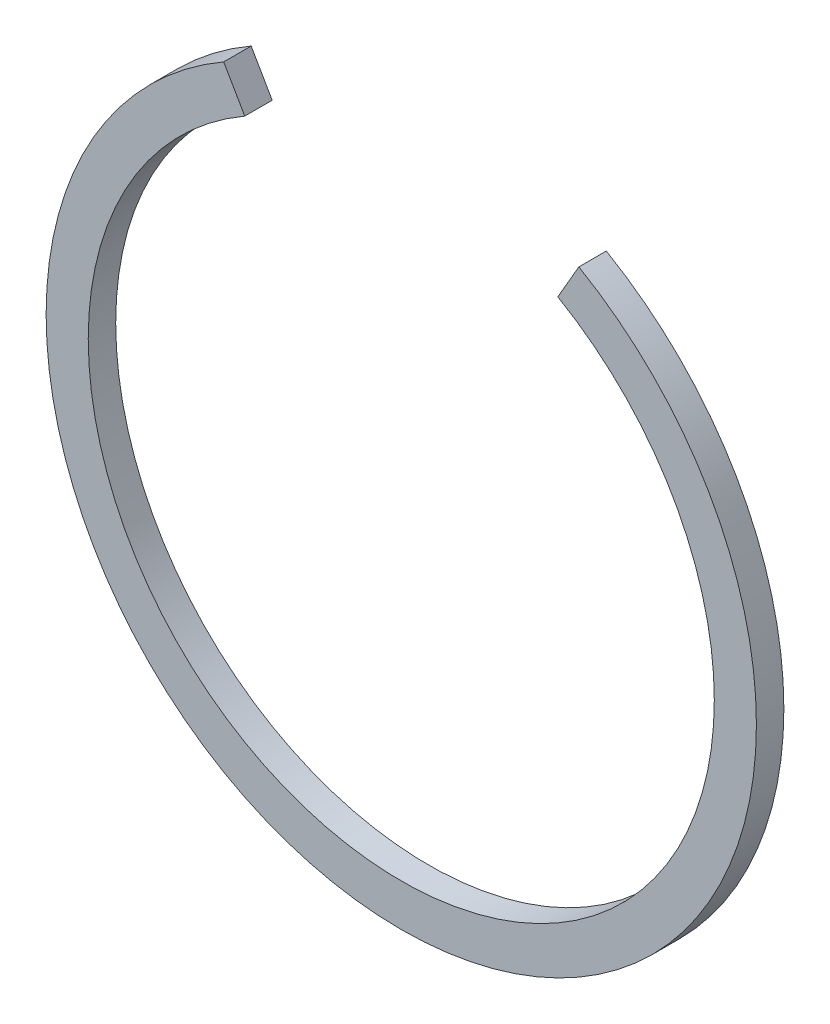
ISO-10303-21;
HEADER;
FILE_DESCRIPTION(('STEP AP214'),'2;1');
FILE_NAME('part.step','',(''),(''),'','','');
FILE_SCHEMA(('AUTOMOTIVE_DESIGN { 1 0 10303 214 1 1 1 1 }'));
ENDSEC;
DATA;
#1=APPLICATION_CONTEXT('core data for automotive mechanical design processes');
#2=APPLICATION_PROTOCOL_DEFINITION('international standard','automotive_design',2000,#1);
#3=PRODUCT_CONTEXT('',#1,'mechanical');
#4=PRODUCT('Part','Part','',(#3));
#5=PRODUCT_RELATED_PRODUCT_CATEGORY('part','',(#4));
#6=PRODUCT_DEFINITION_FORMATION('','',#4);
#7=PRODUCT_DEFINITION_CONTEXT('part definition',#1,'design');
#8=PRODUCT_DEFINITION('design','',#6,#7);
#9=PRODUCT_DEFINITION_SHAPE('','',#8);
#10=(LENGTH_UNIT() NAMED_UNIT(*) SI_UNIT(.MILLI.,.METRE.));
#11=(NAMED_UNIT(*) PLANE_ANGLE_UNIT() SI_UNIT($,.RADIAN.));
#12=(NAMED_UNIT(*) SI_UNIT($,.STERADIAN.) SOLID_ANGLE_UNIT());
#13=UNCERTAINTY_MEASURE_WITH_UNIT(LENGTH_MEASURE(1.E-05),#10,'distance_accuracy_value','');
#14=(GEOMETRIC_REPRESENTATION_CONTEXT(3) GLOBAL_UNCERTAINTY_ASSIGNED_CONTEXT((#13)) GLOBAL_UNIT_ASSIGNED_CONTEXT((#10,
#11,#12)) REPRESENTATION_CONTEXT('',''));
#15=CARTESIAN_POINT('',(0.,0.,0.));
#16=DIRECTION('',(0.,0.,1.));
#17=DIRECTION('',(1.,0.,0.));
#18=AXIS2_PLACEMENT_3D('',#15,#16,#17);
#19=CARTESIAN_POINT('',(0.,0.,1.5));
#20=DIRECTION('',(0.,0.,1.));
#21=DIRECTION('',(1.,0.,0.));
#22=AXIS2_PLACEMENT_3D('',#19,#20,#21);
#23=PLANE('',#22);
#24=CARTESIAN_POINT('',(0.,0.,1.5));
#25=DIRECTION('',(0.,0.,-1.));
#26=DIRECTION('',(-1.,0.,0.));
#27=AXIS2_PLACEMENT_3D('',#24,#25,#26);
#28=CIRCLE('',#27,19.4);
#29=CARTESIAN_POINT('',(-19.4,0.,1.5));
#30=VERTEX_POINT('',#29);
#31=CARTESIAN_POINT('',(-9.7,16.80089283342,1.5));
#32=VERTEX_POINT('',#31);
#33=EDGE_CURVE('E11',#30,#32,#28,.T.);
#34=ORIENTED_EDGE('',*,*,#33,.F.);
#35=CARTESIAN_POINT('',(0.,0.,1.5));
#36=DIRECTION('',(0.,0.,-1.));
#37=DIRECTION('',(1.,0.,0.));
#38=AXIS2_PLACEMENT_3D('',#35,#36,#37);
#39=CIRCLE('',#38,19.4);
#40=CARTESIAN_POINT('',(19.4,0.,1.5));
#41=VERTEX_POINT('',#40);
#42=EDGE_CURVE('E26',#41,#30,#39,.T.);
#43=ORIENTED_EDGE('',*,*,#42,.F.);
#44=CARTESIAN_POINT('',(0.,0.,1.5));
#45=DIRECTION('',(0.,0.,-1.));
#46=DIRECTION('',(0.499999999999974,0.866025403784454,0.));
#47=AXIS2_PLACEMENT_3D('',#44,#45,#46);
#48=CIRCLE('',#47,19.4);
#49=CARTESIAN_POINT('',(9.699999999999,16.80089283342,1.5));
#50=VERTEX_POINT('',#49);
#51=EDGE_CURVE('E145',#50,#41,#48,.T.);
#52=ORIENTED_EDGE('',*,*,#51,.F.);
#53=DIRECTION('',(0.499999999999319,0.866025403784832,0.));
#54=VECTOR('',#53,1.);
#55=CARTESIAN_POINT('',(8.549999999999,14.80903440471,1.5));
#56=LINE('',#55,#54);
#57=CARTESIAN_POINT('',(8.549999999999,14.80903440471,1.5));
#58=VERTEX_POINT('',#57);
#59=EDGE_CURVE('E154',#58,#50,#56,.T.);
#60=ORIENTED_EDGE('',*,*,#59,.F.);
#61=CARTESIAN_POINT('',(0.,0.,1.5));
#62=DIRECTION('',(0.,0.,1.));
#63=DIRECTION('',(1.,0.,0.));
#64=AXIS2_PLACEMENT_3D('',#61,#62,#63);
#65=CIRCLE('',#64,17.1);
#66=CARTESIAN_POINT('',(17.1,0.,1.5));
#67=VERTEX_POINT('',#66);
#68=EDGE_CURVE('E134',#67,#58,#65,.T.);
#69=ORIENTED_EDGE('',*,*,#68,.F.);
#70=CARTESIAN_POINT('',(0.,0.,1.5));
#71=DIRECTION('',(0.,0.,1.));
#72=DIRECTION('',(-1.,0.,0.));
#73=AXIS2_PLACEMENT_3D('',#70,#71,#72);
#74=CIRCLE('',#73,17.1);
#75=CARTESIAN_POINT('',(-17.1,0.,1.5));
#76=VERTEX_POINT('',#75);
#77=EDGE_CURVE('E59',#76,#67,#74,.T.);
#78=ORIENTED_EDGE('',*,*,#77,.F.);
#79=CARTESIAN_POINT('',(0.,0.,1.5));
#80=DIRECTION('',(0.,0.,1.));
#81=DIRECTION('',(-0.500000000000017,0.866025403784429,0.));
#82=AXIS2_PLACEMENT_3D('',#79,#80,#81);
#83=CIRCLE('',#82,17.1);
#84=CARTESIAN_POINT('',(-8.55,14.80903440471,1.5));
#85=VERTEX_POINT('',#84);
#86=EDGE_CURVE('E69',#85,#76,#83,.T.);
#87=ORIENTED_EDGE('',*,*,#86,.F.);
#88=DIRECTION('',(0.499999999999319,-0.866025403784832,0.));
#89=VECTOR('',#88,1.);
#90=CARTESIAN_POINT('',(-9.7,16.80089283342,1.5));
#91=LINE('',#90,#89);
#92=EDGE_CURVE('E110',#32,#85,#91,.T.);
#93=ORIENTED_EDGE('',*,*,#92,.F.);
#94=EDGE_LOOP('',(#34,#43,#52,#60,#69,#78,#87,#93));
#95=FACE_BOUND('',#94,.T.);
#96=ADVANCED_FACE('F17',(#95),#23,.T.);
#97=CARTESIAN_POINT('',(0.,0.,0.));
#98=DIRECTION('',(0.,0.,1.));
#99=DIRECTION('',(1.,0.,0.));
#100=AXIS2_PLACEMENT_3D('',#97,#98,#99);
#101=CYLINDRICAL_SURFACE('',#100,19.4);
#102=DIRECTION('',(3.718506983811E-13,2.273736754432E-13,1.));
#103=VECTOR('',#102,1.);
#104=CARTESIAN_POINT('',(-9.7,16.80089283342,0.));
#105=LINE('',#104,#103);
#106=CARTESIAN_POINT('',(-9.7,16.80089283342,0.));
#107=VERTEX_POINT('',#106);
#108=EDGE_CURVE('E122',#107,#32,#105,.T.);
#109=ORIENTED_EDGE('',*,*,#108,.F.);
#110=CARTESIAN_POINT('',(0.,0.,0.));
#111=DIRECTION('',(0.,0.,1.));
#112=DIRECTION('',(-0.500000000000017,0.866025403784429,0.));
#113=AXIS2_PLACEMENT_3D('',#110,#111,#112);
#114=CIRCLE('',#113,19.4);
#115=CARTESIAN_POINT('',(-19.4,0.,0.));
#116=VERTEX_POINT('',#115);
#117=EDGE_CURVE('E120',#107,#116,#114,.T.);
#118=ORIENTED_EDGE('',*,*,#117,.T.);
#119=CARTESIAN_POINT('',(0.,0.,0.));
#120=DIRECTION('',(0.,0.,1.));
#121=DIRECTION('',(-1.,0.,0.));
#122=AXIS2_PLACEMENT_3D('',#119,#120,#121);
#123=CIRCLE('',#122,19.4);
#124=CARTESIAN_POINT('',(19.4,0.,0.));
#125=VERTEX_POINT('',#124);
#126=EDGE_CURVE('E137',#116,#125,#123,.T.);
#127=ORIENTED_EDGE('',*,*,#126,.T.);
#128=CARTESIAN_POINT('',(0.,0.,0.));
#129=DIRECTION('',(0.,0.,1.));
#130=DIRECTION('',(1.,0.,0.));
#131=AXIS2_PLACEMENT_3D('',#128,#129,#130);
#132=CIRCLE('',#131,19.4);
#133=CARTESIAN_POINT('',(9.699999999998,16.80089283342,0.));
#134=VERTEX_POINT('',#133);
#135=EDGE_CURVE('E138',#125,#134,#132,.T.);
#136=ORIENTED_EDGE('',*,*,#135,.T.);
#137=DIRECTION('',(-3.765876499529E-13,2.13162820728E-13,-1.));
#138=VECTOR('',#137,1.);
#139=CARTESIAN_POINT('',(9.699999999999,16.80089283342,1.5));
#140=LINE('',#139,#138);
#141=EDGE_CURVE('E147',#50,#134,#140,.T.);
#142=ORIENTED_EDGE('',*,*,#141,.F.);
#143=ORIENTED_EDGE('',*,*,#51,.T.);
#144=ORIENTED_EDGE('',*,*,#42,.T.);
#145=ORIENTED_EDGE('',*,*,#33,.T.);
#146=EDGE_LOOP('',(#109,#118,#127,#136,#142,#143,#144,#145));
#147=FACE_BOUND('',#146,.T.);
#148=ADVANCED_FACE('F184',(#147),#101,.T.);
#149=CARTESIAN_POINT('',(12.64071899543,21.89436754429,0.));
#150=DIRECTION('',(0.866025403784429,-0.500000000000017,0.));
#151=DIRECTION('',(0.,0.,-1.));
#152=AXIS2_PLACEMENT_3D('',#149,#150,#151);
#153=PLANE('',#152);
#154=DIRECTION('',(3.836930773105E-13,-2.013204417987E-13,1.));
#155=VECTOR('',#154,1.);
#156=CARTESIAN_POINT('',(8.549999999999,14.80903440471,0.));
#157=LINE('',#156,#155);
#158=CARTESIAN_POINT('',(8.549999999999,14.80903440471,0.));
#159=VERTEX_POINT('',#158);
#160=EDGE_CURVE('E158',#159,#58,#157,.T.);
#161=ORIENTED_EDGE('',*,*,#160,.T.);
#162=ORIENTED_EDGE('',*,*,#59,.T.);
#163=ORIENTED_EDGE('',*,*,#141,.T.);
#164=DIRECTION('',(-0.499999999999319,-0.866025403784832,0.));
#165=VECTOR('',#164,1.);
#166=CARTESIAN_POINT('',(9.699999999998,16.80089283342,0.));
#167=LINE('',#166,#165);
#168=EDGE_CURVE('E142',#134,#159,#167,.T.);
#169=ORIENTED_EDGE('',*,*,#168,.T.);
#170=EDGE_LOOP('',(#161,#162,#163,#169));
#171=FACE_BOUND('',#170,.T.);
#172=ADVANCED_FACE('F180',(#171),#153,.F.);
#173=CARTESIAN_POINT('',(0.,0.,0.));
#174=DIRECTION('',(0.,0.,1.));
#175=DIRECTION('',(1.,0.,0.));
#176=AXIS2_PLACEMENT_3D('',#173,#174,#175);
#177=CYLINDRICAL_SURFACE('',#176,17.1);
#178=DIRECTION('',(-3.801403636317E-13,-2.107943449422E-13,-1.));
#179=VECTOR('',#178,1.);
#180=CARTESIAN_POINT('',(-8.55,14.80903440471,1.5));
#181=LINE('',#180,#179);
#182=CARTESIAN_POINT('',(-8.550000000001,14.80903440471,0.));
#183=VERTEX_POINT('',#182);
#184=EDGE_CURVE('E20',#85,#183,#181,.T.);
#185=ORIENTED_EDGE('',*,*,#184,.F.);
#186=ORIENTED_EDGE('',*,*,#86,.T.);
#187=ORIENTED_EDGE('',*,*,#77,.T.);
#188=ORIENTED_EDGE('',*,*,#68,.T.);
#189=ORIENTED_EDGE('',*,*,#160,.F.);
#190=CARTESIAN_POINT('',(0.,0.,0.));
#191=DIRECTION('',(0.,0.,-1.));
#192=DIRECTION('',(0.499999999999974,0.866025403784454,0.));
#193=AXIS2_PLACEMENT_3D('',#190,#191,#192);
#194=CIRCLE('',#193,17.1);
#195=CARTESIAN_POINT('',(17.1,0.,0.));
#196=VERTEX_POINT('',#195);
#197=EDGE_CURVE('E130',#159,#196,#194,.T.);
#198=ORIENTED_EDGE('',*,*,#197,.T.);
#199=CARTESIAN_POINT('',(0.,0.,0.));
#200=DIRECTION('',(0.,0.,-1.));
#201=DIRECTION('',(1.,0.,0.));
#202=AXIS2_PLACEMENT_3D('',#199,#200,#201);
#203=CIRCLE('',#202,17.1);
#204=CARTESIAN_POINT('',(-17.1,0.,0.));
#205=VERTEX_POINT('',#204);
#206=EDGE_CURVE('E124',#196,#205,#203,.T.);
#207=ORIENTED_EDGE('',*,*,#206,.T.);
#208=CARTESIAN_POINT('',(0.,0.,0.));
#209=DIRECTION('',(0.,0.,-1.));
#210=DIRECTION('',(-1.,0.,0.));
#211=AXIS2_PLACEMENT_3D('',#208,#209,#210);
#212=CIRCLE('',#211,17.1);
#213=EDGE_CURVE('E118',#205,#183,#212,.T.);
#214=ORIENTED_EDGE('',*,*,#213,.T.);
#215=EDGE_LOOP('',(#185,#186,#187,#188,#189,#198,#207,#214));
#216=FACE_BOUND('',#215,.T.);
#217=ADVANCED_FACE('F123',(#216),#177,.F.);
#218=CARTESIAN_POINT('',(0.,0.,0.));
#219=DIRECTION('',(-0.866025403784429,-0.500000000000017,0.));
#220=DIRECTION('',(-0.500000000000017,0.866025403784429,0.));
#221=AXIS2_PLACEMENT_3D('',#218,#219,#220);
#222=PLANE('',#221);
#223=ORIENTED_EDGE('',*,*,#108,.T.);
#224=ORIENTED_EDGE('',*,*,#92,.T.);
#225=ORIENTED_EDGE('',*,*,#184,.T.);
#226=DIRECTION('',(-0.499999999999319,0.866025403784832,0.));
#227=VECTOR('',#226,1.);
#228=CARTESIAN_POINT('',(-8.550000000001,14.80903440471,0.));
#229=LINE('',#228,#227);
#230=EDGE_CURVE('E108',#183,#107,#229,.T.);
#231=ORIENTED_EDGE('',*,*,#230,.T.);
#232=EDGE_LOOP('',(#223,#224,#225,#231));
#233=FACE_BOUND('',#232,.T.);
#234=ADVANCED_FACE('F107',(#233),#222,.F.);
#235=CARTESIAN_POINT('',(0.,0.,0.));
#236=DIRECTION('',(0.,0.,1.));
#237=DIRECTION('',(1.,0.,0.));
#238=AXIS2_PLACEMENT_3D('',#235,#236,#237);
#239=PLANE('',#238);
#240=ORIENTED_EDGE('',*,*,#213,.F.);
#241=ORIENTED_EDGE('',*,*,#206,.F.);
#242=ORIENTED_EDGE('',*,*,#197,.F.);
#243=ORIENTED_EDGE('',*,*,#168,.F.);
#244=ORIENTED_EDGE('',*,*,#135,.F.);
#245=ORIENTED_EDGE('',*,*,#126,.F.);
#246=ORIENTED_EDGE('',*,*,#117,.F.);
#247=ORIENTED_EDGE('',*,*,#230,.F.);
#248=EDGE_LOOP('',(#240,#241,#242,#243,#244,#245,#246,#247));
#249=FACE_BOUND('',#248,.T.);
#250=ADVANCED_FACE('F116',(#249),#239,.F.);
#251=CLOSED_SHELL('',(#96,#148,#172,#217,#234,#250));
#252=MANIFOLD_SOLID_BREP('B1',#251);
#253=ADVANCED_BREP_SHAPE_REPRESENTATION('',(#18,#252),#14);
#254=SHAPE_DEFINITION_REPRESENTATION(#9,#253);
ENDSEC;
END-ISO-10303-21;
